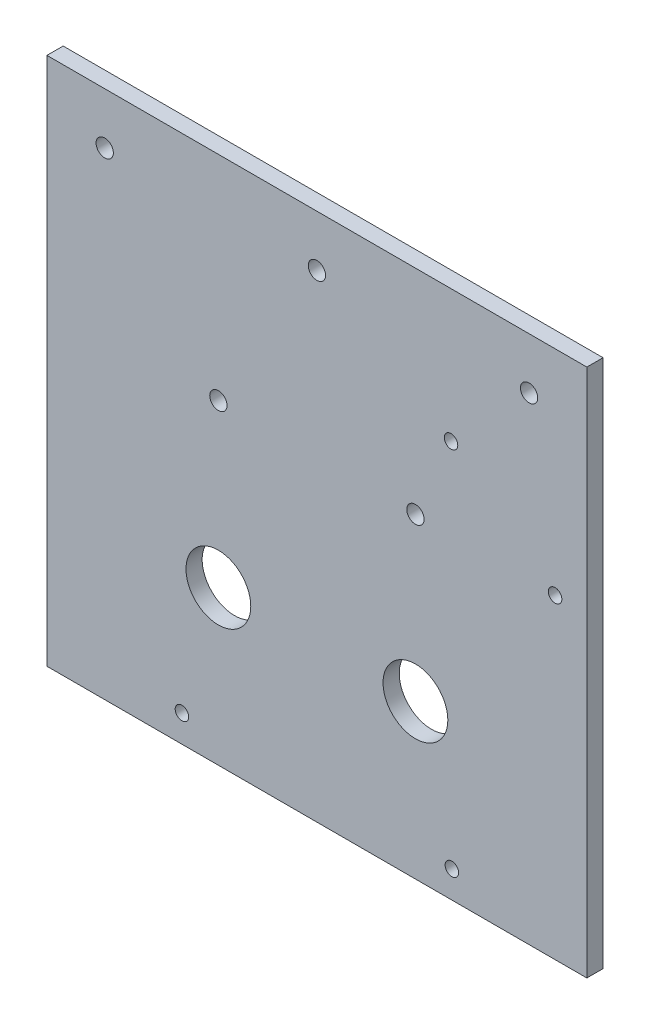
ISO-10303-21;
HEADER;
FILE_DESCRIPTION(('STEP AP214'),'2;1');
FILE_NAME('part.step','',(''),(''),'','','');
FILE_SCHEMA(('AUTOMOTIVE_DESIGN { 1 0 10303 214 1 1 1 1 }'));
ENDSEC;
DATA;
#1=APPLICATION_CONTEXT('core data for automotive mechanical design processes');
#2=APPLICATION_PROTOCOL_DEFINITION('international standard','automotive_design',2000,#1);
#3=PRODUCT_CONTEXT('',#1,'mechanical');
#4=PRODUCT('Part','Part','',(#3));
#5=PRODUCT_RELATED_PRODUCT_CATEGORY('part','',(#4));
#6=PRODUCT_DEFINITION_FORMATION('','',#4);
#7=PRODUCT_DEFINITION_CONTEXT('part definition',#1,'design');
#8=PRODUCT_DEFINITION('design','',#6,#7);
#9=PRODUCT_DEFINITION_SHAPE('','',#8);
#10=(LENGTH_UNIT() NAMED_UNIT(*) SI_UNIT(.MILLI.,.METRE.));
#11=(NAMED_UNIT(*) PLANE_ANGLE_UNIT() SI_UNIT($,.RADIAN.));
#12=(NAMED_UNIT(*) SI_UNIT($,.STERADIAN.) SOLID_ANGLE_UNIT());
#13=UNCERTAINTY_MEASURE_WITH_UNIT(LENGTH_MEASURE(1.E-05),#10,'distance_accuracy_value','');
#14=(GEOMETRIC_REPRESENTATION_CONTEXT(3) GLOBAL_UNCERTAINTY_ASSIGNED_CONTEXT((#13)) GLOBAL_UNIT_ASSIGNED_CONTEXT((#10,
#11,#12)) REPRESENTATION_CONTEXT('',''));
#15=CARTESIAN_POINT('',(0.,0.,0.));
#16=DIRECTION('',(0.,0.,1.));
#17=DIRECTION('',(1.,0.,0.));
#18=AXIS2_PLACEMENT_3D('',#15,#16,#17);
#19=CARTESIAN_POINT('',(50.,49.5,3.));
#20=DIRECTION('',(-1.,0.,0.));
#21=DIRECTION('',(0.,-1.,0.));
#22=AXIS2_PLACEMENT_3D('',#19,#20,#21);
#23=PLANE('',#22);
#24=DIRECTION('',(0.,0.,1.));
#25=VECTOR('',#24,1.);
#26=CARTESIAN_POINT('',(50.,-48.5,3.));
#27=LINE('',#26,#25);
#28=CARTESIAN_POINT('',(50.,-48.5,0.));
#29=VERTEX_POINT('',#28);
#30=CARTESIAN_POINT('',(50.,-48.5,3.));
#31=VERTEX_POINT('',#30);
#32=EDGE_CURVE('E117',#29,#31,#27,.T.);
#33=ORIENTED_EDGE('',*,*,#32,.F.);
#34=DIRECTION('',(0.,1.,0.));
#35=VECTOR('',#34,1.);
#36=CARTESIAN_POINT('',(50.,49.5,0.));
#37=LINE('',#36,#35);
#38=CARTESIAN_POINT('',(50.,49.5,0.));
#39=VERTEX_POINT('',#38);
#40=EDGE_CURVE('E80',#29,#39,#37,.T.);
#41=ORIENTED_EDGE('',*,*,#40,.T.);
#42=DIRECTION('',(0.,0.,-1.));
#43=VECTOR('',#42,1.);
#44=CARTESIAN_POINT('',(50.,49.5,3.));
#45=LINE('',#44,#43);
#46=CARTESIAN_POINT('',(50.,49.5,3.));
#47=VERTEX_POINT('',#46);
#48=EDGE_CURVE('E42',#47,#39,#45,.T.);
#49=ORIENTED_EDGE('',*,*,#48,.F.);
#50=DIRECTION('',(0.,1.,0.));
#51=VECTOR('',#50,1.);
#52=CARTESIAN_POINT('',(50.,49.5,3.));
#53=LINE('',#52,#51);
#54=EDGE_CURVE('E88',#31,#47,#53,.T.);
#55=ORIENTED_EDGE('',*,*,#54,.F.);
#56=EDGE_LOOP('',(#33,#41,#49,#55));
#57=FACE_BOUND('',#56,.T.);
#58=ADVANCED_FACE('F34',(#57),#23,.F.);
#59=CARTESIAN_POINT('',(-50.,49.5,3.));
#60=DIRECTION('',(1.,0.,0.));
#61=DIRECTION('',(0.,1.,0.));
#62=AXIS2_PLACEMENT_3D('',#59,#60,#61);
#63=PLANE('',#62);
#64=DIRECTION('',(0.,0.,-1.));
#65=VECTOR('',#64,1.);
#66=CARTESIAN_POINT('',(-50.,-48.5,3.));
#67=LINE('',#66,#65);
#68=CARTESIAN_POINT('',(-50.,-48.5,3.));
#69=VERTEX_POINT('',#68);
#70=CARTESIAN_POINT('',(-50.,-48.5,0.));
#71=VERTEX_POINT('',#70);
#72=EDGE_CURVE('E48',#69,#71,#67,.T.);
#73=ORIENTED_EDGE('',*,*,#72,.F.);
#74=DIRECTION('',(0.,-1.,0.));
#75=VECTOR('',#74,1.);
#76=CARTESIAN_POINT('',(-50.,49.5,3.));
#77=LINE('',#76,#75);
#78=CARTESIAN_POINT('',(-50.,49.5,3.));
#79=VERTEX_POINT('',#78);
#80=EDGE_CURVE('E85',#79,#69,#77,.T.);
#81=ORIENTED_EDGE('',*,*,#80,.F.);
#82=DIRECTION('',(0.,0.,-1.));
#83=VECTOR('',#82,1.);
#84=CARTESIAN_POINT('',(-50.,49.5,3.));
#85=LINE('',#84,#83);
#86=CARTESIAN_POINT('',(-50.,49.5,0.));
#87=VERTEX_POINT('',#86);
#88=EDGE_CURVE('E73',#79,#87,#85,.T.);
#89=ORIENTED_EDGE('',*,*,#88,.T.);
#90=DIRECTION('',(0.,-1.,0.));
#91=VECTOR('',#90,1.);
#92=CARTESIAN_POINT('',(-50.,49.5,0.));
#93=LINE('',#92,#91);
#94=EDGE_CURVE('E79',#87,#71,#93,.T.);
#95=ORIENTED_EDGE('',*,*,#94,.T.);
#96=EDGE_LOOP('',(#73,#81,#89,#95));
#97=FACE_BOUND('',#96,.T.);
#98=ADVANCED_FACE('F84',(#97),#63,.F.);
#99=CARTESIAN_POINT('',(0.,0.,3.));
#100=DIRECTION('',(0.,0.,1.));
#101=DIRECTION('',(1.,0.,0.));
#102=AXIS2_PLACEMENT_3D('',#99,#100,#101);
#103=PLANE('',#102);
#104=CARTESIAN_POINT('',(39.3,40.,3.));
#105=DIRECTION('',(0.,0.,1.));
#106=DIRECTION('',(1.,0.,0.));
#107=AXIS2_PLACEMENT_3D('',#104,#105,#106);
#108=CIRCLE('',#107,1.6);
#109=CARTESIAN_POINT('',(40.9,40.,3.));
#110=VERTEX_POINT('',#109);
#111=EDGE_CURVE('E152',#110,#110,#108,.T.);
#112=ORIENTED_EDGE('',*,*,#111,.F.);
#113=EDGE_LOOP('',(#112));
#114=FACE_BOUND('',#113,.T.);
#115=CARTESIAN_POINT('',(-39.3,40.,3.));
#116=DIRECTION('',(0.,0.,1.));
#117=DIRECTION('',(1.,0.,0.));
#118=AXIS2_PLACEMENT_3D('',#115,#116,#117);
#119=CIRCLE('',#118,1.6);
#120=CARTESIAN_POINT('',(-37.7,40.,3.));
#121=VERTEX_POINT('',#120);
#122=EDGE_CURVE('E157',#121,#121,#119,.T.);
#123=ORIENTED_EDGE('',*,*,#122,.F.);
#124=EDGE_LOOP('',(#123));
#125=FACE_BOUND('',#124,.T.);
#126=CARTESIAN_POINT('',(-18.25,10.,3.));
#127=DIRECTION('',(0.,0.,1.));
#128=DIRECTION('',(1.,0.,0.));
#129=AXIS2_PLACEMENT_3D('',#126,#127,#128);
#130=CIRCLE('',#129,1.6);
#131=CARTESIAN_POINT('',(-16.65,10.,3.));
#132=VERTEX_POINT('',#131);
#133=EDGE_CURVE('E142',#132,#132,#130,.T.);
#134=ORIENTED_EDGE('',*,*,#133,.F.);
#135=EDGE_LOOP('',(#134));
#136=FACE_BOUND('',#135,.T.);
#137=CARTESIAN_POINT('',(18.25,10.,3.));
#138=DIRECTION('',(0.,0.,1.));
#139=DIRECTION('',(1.,0.,0.));
#140=AXIS2_PLACEMENT_3D('',#137,#138,#139);
#141=CIRCLE('',#140,1.6);
#142=CARTESIAN_POINT('',(19.85,10.,3.));
#143=VERTEX_POINT('',#142);
#144=EDGE_CURVE('E145',#143,#143,#141,.T.);
#145=ORIENTED_EDGE('',*,*,#144,.F.);
#146=EDGE_LOOP('',(#145));
#147=FACE_BOUND('',#146,.T.);
#148=CARTESIAN_POINT('',(44.1226231407565,9.93476369878118,3.));
#149=DIRECTION('',(0.,0.,1.));
#150=DIRECTION('',(1.,0.,0.));
#151=AXIS2_PLACEMENT_3D('',#148,#149,#150);
#152=CIRCLE('',#151,1.24999999999999);
#153=CARTESIAN_POINT('',(45.3726231407565,9.93476369878118,3.));
#154=VERTEX_POINT('',#153);
#155=EDGE_CURVE('E136',#154,#154,#152,.T.);
#156=ORIENTED_EDGE('',*,*,#155,.F.);
#157=EDGE_LOOP('',(#156));
#158=FACE_BOUND('',#157,.T.);
#159=CARTESIAN_POINT('',(24.84,25.,3.));
#160=DIRECTION('',(0.,0.,1.));
#161=DIRECTION('',(1.,0.,0.));
#162=AXIS2_PLACEMENT_3D('',#159,#160,#161);
#163=CIRCLE('',#162,1.24999999999999);
#164=CARTESIAN_POINT('',(26.09,25.,3.));
#165=VERTEX_POINT('',#164);
#166=EDGE_CURVE('E37',#165,#165,#163,.T.);
#167=ORIENTED_EDGE('',*,*,#166,.F.);
#168=EDGE_LOOP('',(#167));
#169=FACE_BOUND('',#168,.T.);
#170=CARTESIAN_POINT('',(25.,-43.5,3.));
#171=DIRECTION('',(0.,0.,1.));
#172=DIRECTION('',(1.,0.,0.));
#173=AXIS2_PLACEMENT_3D('',#170,#171,#172);
#174=CIRCLE('',#173,1.24999999999999);
#175=CARTESIAN_POINT('',(26.25,-43.5,3.));
#176=VERTEX_POINT('',#175);
#177=EDGE_CURVE('E130',#176,#176,#174,.T.);
#178=ORIENTED_EDGE('',*,*,#177,.F.);
#179=EDGE_LOOP('',(#178));
#180=FACE_BOUND('',#179,.T.);
#181=CARTESIAN_POINT('',(-25.,-43.5,3.));
#182=DIRECTION('',(0.,0.,1.));
#183=DIRECTION('',(1.,0.,0.));
#184=AXIS2_PLACEMENT_3D('',#181,#182,#183);
#185=CIRCLE('',#184,1.24999999999999);
#186=CARTESIAN_POINT('',(-23.75,-43.5,3.));
#187=VERTEX_POINT('',#186);
#188=EDGE_CURVE('E124',#187,#187,#185,.T.);
#189=ORIENTED_EDGE('',*,*,#188,.F.);
#190=EDGE_LOOP('',(#189));
#191=FACE_BOUND('',#190,.T.);
#192=CARTESIAN_POINT('',(0.,40.,3.));
#193=DIRECTION('',(0.,0.,1.));
#194=DIRECTION('',(1.,0.,0.));
#195=AXIS2_PLACEMENT_3D('',#192,#193,#194);
#196=CIRCLE('',#195,1.6);
#197=CARTESIAN_POINT('',(1.6,40.,3.));
#198=VERTEX_POINT('',#197);
#199=EDGE_CURVE('E110',#198,#198,#196,.T.);
#200=ORIENTED_EDGE('',*,*,#199,.F.);
#201=EDGE_LOOP('',(#200));
#202=FACE_BOUND('',#201,.T.);
#203=CARTESIAN_POINT('',(-18.25,-20.,3.));
#204=DIRECTION('',(0.,0.,1.));
#205=DIRECTION('',(1.,0.,0.));
#206=AXIS2_PLACEMENT_3D('',#203,#204,#205);
#207=CIRCLE('',#206,6.);
#208=CARTESIAN_POINT('',(-12.25,-20.,3.));
#209=VERTEX_POINT('',#208);
#210=EDGE_CURVE('E104',#209,#209,#207,.T.);
#211=ORIENTED_EDGE('',*,*,#210,.F.);
#212=EDGE_LOOP('',(#211));
#213=FACE_BOUND('',#212,.T.);
#214=CARTESIAN_POINT('',(18.25,-20.,3.));
#215=DIRECTION('',(0.,0.,1.));
#216=DIRECTION('',(1.,0.,0.));
#217=AXIS2_PLACEMENT_3D('',#214,#215,#216);
#218=CIRCLE('',#217,6.);
#219=CARTESIAN_POINT('',(24.25,-20.,3.));
#220=VERTEX_POINT('',#219);
#221=EDGE_CURVE('E97',#220,#220,#218,.T.);
#222=ORIENTED_EDGE('',*,*,#221,.F.);
#223=EDGE_LOOP('',(#222));
#224=FACE_BOUND('',#223,.T.);
#225=ORIENTED_EDGE('',*,*,#80,.T.);
#226=DIRECTION('',(1.,0.,0.));
#227=VECTOR('',#226,1.);
#228=CARTESIAN_POINT('',(0.,-48.5,3.));
#229=LINE('',#228,#227);
#230=EDGE_CURVE('E101',#69,#31,#229,.T.);
#231=ORIENTED_EDGE('',*,*,#230,.T.);
#232=ORIENTED_EDGE('',*,*,#54,.T.);
#233=DIRECTION('',(-1.,0.,0.));
#234=VECTOR('',#233,1.);
#235=CARTESIAN_POINT('',(-50.,49.5,3.));
#236=LINE('',#235,#234);
#237=EDGE_CURVE('E57',#47,#79,#236,.T.);
#238=ORIENTED_EDGE('',*,*,#237,.T.);
#239=EDGE_LOOP('',(#225,#231,#232,#238));
#240=FACE_BOUND('',#239,.T.);
#241=ADVANCED_FACE('F171',(#114,#125,#136,#147,#158,#169,#180,#191,#202,#213,#224,#240),#103,.T.);
#242=CARTESIAN_POINT('',(0.,0.,0.));
#243=DIRECTION('',(0.,0.,1.));
#244=DIRECTION('',(1.,0.,0.));
#245=AXIS2_PLACEMENT_3D('',#242,#243,#244);
#246=PLANE('',#245);
#247=CARTESIAN_POINT('',(39.3,40.,0.));
#248=DIRECTION('',(0.,0.,-1.));
#249=DIRECTION('',(-1.,0.,0.));
#250=AXIS2_PLACEMENT_3D('',#247,#248,#249);
#251=CIRCLE('',#250,1.6);
#252=CARTESIAN_POINT('',(37.7,40.,0.));
#253=VERTEX_POINT('',#252);
#254=EDGE_CURVE('E160',#253,#253,#251,.T.);
#255=ORIENTED_EDGE('',*,*,#254,.F.);
#256=EDGE_LOOP('',(#255));
#257=FACE_BOUND('',#256,.T.);
#258=CARTESIAN_POINT('',(-39.3,40.,0.));
#259=DIRECTION('',(0.,0.,-1.));
#260=DIRECTION('',(-1.,0.,0.));
#261=AXIS2_PLACEMENT_3D('',#258,#259,#260);
#262=CIRCLE('',#261,1.6);
#263=CARTESIAN_POINT('',(-40.9,40.,0.));
#264=VERTEX_POINT('',#263);
#265=EDGE_CURVE('E161',#264,#264,#262,.T.);
#266=ORIENTED_EDGE('',*,*,#265,.F.);
#267=EDGE_LOOP('',(#266));
#268=FACE_BOUND('',#267,.T.);
#269=CARTESIAN_POINT('',(-18.25,10.,0.));
#270=DIRECTION('',(0.,0.,-1.));
#271=DIRECTION('',(-1.,0.,0.));
#272=AXIS2_PLACEMENT_3D('',#269,#270,#271);
#273=CIRCLE('',#272,1.6);
#274=CARTESIAN_POINT('',(-19.85,10.,0.));
#275=VERTEX_POINT('',#274);
#276=EDGE_CURVE('E148',#275,#275,#273,.T.);
#277=ORIENTED_EDGE('',*,*,#276,.F.);
#278=EDGE_LOOP('',(#277));
#279=FACE_BOUND('',#278,.T.);
#280=CARTESIAN_POINT('',(18.25,10.,0.));
#281=DIRECTION('',(0.,0.,-1.));
#282=DIRECTION('',(-1.,0.,0.));
#283=AXIS2_PLACEMENT_3D('',#280,#281,#282);
#284=CIRCLE('',#283,1.6);
#285=CARTESIAN_POINT('',(16.65,10.,0.));
#286=VERTEX_POINT('',#285);
#287=EDGE_CURVE('E149',#286,#286,#284,.T.);
#288=ORIENTED_EDGE('',*,*,#287,.F.);
#289=EDGE_LOOP('',(#288));
#290=FACE_BOUND('',#289,.T.);
#291=CARTESIAN_POINT('',(44.1226231407565,9.93476369878118,0.));
#292=DIRECTION('',(0.,0.,-1.));
#293=DIRECTION('',(-1.,0.,0.));
#294=AXIS2_PLACEMENT_3D('',#291,#292,#293);
#295=CIRCLE('',#294,1.24999999999999);
#296=CARTESIAN_POINT('',(42.8726231407565,9.93476369878118,0.));
#297=VERTEX_POINT('',#296);
#298=EDGE_CURVE('E139',#297,#297,#295,.T.);
#299=ORIENTED_EDGE('',*,*,#298,.F.);
#300=EDGE_LOOP('',(#299));
#301=FACE_BOUND('',#300,.T.);
#302=CARTESIAN_POINT('',(24.84,25.,0.));
#303=DIRECTION('',(0.,0.,-1.));
#304=DIRECTION('',(-1.,0.,0.));
#305=AXIS2_PLACEMENT_3D('',#302,#303,#304);
#306=CIRCLE('',#305,1.24999999999999);
#307=CARTESIAN_POINT('',(23.59,25.,0.));
#308=VERTEX_POINT('',#307);
#309=EDGE_CURVE('E133',#308,#308,#306,.T.);
#310=ORIENTED_EDGE('',*,*,#309,.F.);
#311=EDGE_LOOP('',(#310));
#312=FACE_BOUND('',#311,.T.);
#313=CARTESIAN_POINT('',(25.,-43.5,0.));
#314=DIRECTION('',(0.,0.,1.));
#315=DIRECTION('',(1.,0.,0.));
#316=AXIS2_PLACEMENT_3D('',#313,#314,#315);
#317=CIRCLE('',#316,1.24999999999999);
#318=CARTESIAN_POINT('',(26.25,-43.5,0.));
#319=VERTEX_POINT('',#318);
#320=EDGE_CURVE('E127',#319,#319,#317,.T.);
#321=ORIENTED_EDGE('',*,*,#320,.T.);
#322=EDGE_LOOP('',(#321));
#323=FACE_BOUND('',#322,.T.);
#324=CARTESIAN_POINT('',(-25.,-43.5,0.));
#325=DIRECTION('',(0.,0.,1.));
#326=DIRECTION('',(1.,0.,0.));
#327=AXIS2_PLACEMENT_3D('',#324,#325,#326);
#328=CIRCLE('',#327,1.24999999999999);
#329=CARTESIAN_POINT('',(-23.75,-43.5,0.));
#330=VERTEX_POINT('',#329);
#331=EDGE_CURVE('E121',#330,#330,#328,.T.);
#332=ORIENTED_EDGE('',*,*,#331,.T.);
#333=EDGE_LOOP('',(#332));
#334=FACE_BOUND('',#333,.T.);
#335=CARTESIAN_POINT('',(18.25,-20.,0.));
#336=DIRECTION('',(0.,0.,1.));
#337=DIRECTION('',(1.,0.,0.));
#338=AXIS2_PLACEMENT_3D('',#335,#336,#337);
#339=CIRCLE('',#338,6.);
#340=CARTESIAN_POINT('',(24.25,-20.,0.));
#341=VERTEX_POINT('',#340);
#342=EDGE_CURVE('E100',#341,#341,#339,.T.);
#343=ORIENTED_EDGE('',*,*,#342,.T.);
#344=EDGE_LOOP('',(#343));
#345=FACE_BOUND('',#344,.T.);
#346=CARTESIAN_POINT('',(-18.25,-20.,0.));
#347=DIRECTION('',(0.,0.,1.));
#348=DIRECTION('',(1.,0.,0.));
#349=AXIS2_PLACEMENT_3D('',#346,#347,#348);
#350=CIRCLE('',#349,6.);
#351=CARTESIAN_POINT('',(-12.25,-20.,0.));
#352=VERTEX_POINT('',#351);
#353=EDGE_CURVE('E107',#352,#352,#350,.T.);
#354=ORIENTED_EDGE('',*,*,#353,.T.);
#355=EDGE_LOOP('',(#354));
#356=FACE_BOUND('',#355,.T.);
#357=CARTESIAN_POINT('',(0.,40.,0.));
#358=DIRECTION('',(0.,0.,1.));
#359=DIRECTION('',(1.,0.,0.));
#360=AXIS2_PLACEMENT_3D('',#357,#358,#359);
#361=CIRCLE('',#360,1.6);
#362=CARTESIAN_POINT('',(1.6,40.,0.));
#363=VERTEX_POINT('',#362);
#364=EDGE_CURVE('E94',#363,#363,#361,.T.);
#365=ORIENTED_EDGE('',*,*,#364,.T.);
#366=EDGE_LOOP('',(#365));
#367=FACE_BOUND('',#366,.T.);
#368=DIRECTION('',(1.,0.,0.));
#369=VECTOR('',#368,1.);
#370=CARTESIAN_POINT('',(0.,-48.5,0.));
#371=LINE('',#370,#369);
#372=EDGE_CURVE('E11',#71,#29,#371,.T.);
#373=ORIENTED_EDGE('',*,*,#372,.F.);
#374=ORIENTED_EDGE('',*,*,#94,.F.);
#375=DIRECTION('',(-1.,0.,0.));
#376=VECTOR('',#375,1.);
#377=CARTESIAN_POINT('',(-50.,49.5,0.));
#378=LINE('',#377,#376);
#379=EDGE_CURVE('E70',#39,#87,#378,.T.);
#380=ORIENTED_EDGE('',*,*,#379,.F.);
#381=ORIENTED_EDGE('',*,*,#40,.F.);
#382=EDGE_LOOP('',(#373,#374,#380,#381));
#383=FACE_BOUND('',#382,.T.);
#384=ADVANCED_FACE('F87',(#257,#268,#279,#290,#301,#312,#323,#334,#345,#356,#367,#383),#246,.F.);
#385=CARTESIAN_POINT('',(-50.,49.5,3.));
#386=DIRECTION('',(0.,-1.,0.));
#387=DIRECTION('',(0.,0.,-1.));
#388=AXIS2_PLACEMENT_3D('',#385,#386,#387);
#389=PLANE('',#388);
#390=ORIENTED_EDGE('',*,*,#379,.T.);
#391=ORIENTED_EDGE('',*,*,#88,.F.);
#392=ORIENTED_EDGE('',*,*,#237,.F.);
#393=ORIENTED_EDGE('',*,*,#48,.T.);
#394=EDGE_LOOP('',(#390,#391,#392,#393));
#395=FACE_BOUND('',#394,.T.);
#396=ADVANCED_FACE('F72',(#395),#389,.F.);
#397=CARTESIAN_POINT('',(18.25,-20.,0.));
#398=DIRECTION('',(0.,0.,1.));
#399=DIRECTION('',(1.,0.,0.));
#400=AXIS2_PLACEMENT_3D('',#397,#398,#399);
#401=CYLINDRICAL_SURFACE('',#400,6.);
#402=ORIENTED_EDGE('',*,*,#342,.F.);
#403=EDGE_LOOP('',(#402));
#404=FACE_BOUND('',#403,.T.);
#405=ORIENTED_EDGE('',*,*,#221,.T.);
#406=EDGE_LOOP('',(#405));
#407=FACE_BOUND('',#406,.T.);
#408=ADVANCED_FACE('F224',(#404,#407),#401,.F.);
#409=CARTESIAN_POINT('',(-18.25,-20.,0.));
#410=DIRECTION('',(0.,0.,1.));
#411=DIRECTION('',(1.,0.,0.));
#412=AXIS2_PLACEMENT_3D('',#409,#410,#411);
#413=CYLINDRICAL_SURFACE('',#412,6.);
#414=ORIENTED_EDGE('',*,*,#353,.F.);
#415=EDGE_LOOP('',(#414));
#416=FACE_BOUND('',#415,.T.);
#417=ORIENTED_EDGE('',*,*,#210,.T.);
#418=EDGE_LOOP('',(#417));
#419=FACE_BOUND('',#418,.T.);
#420=ADVANCED_FACE('F197',(#416,#419),#413,.F.);
#421=CARTESIAN_POINT('',(0.,40.,0.));
#422=DIRECTION('',(0.,0.,1.));
#423=DIRECTION('',(1.,0.,0.));
#424=AXIS2_PLACEMENT_3D('',#421,#422,#423);
#425=CYLINDRICAL_SURFACE('',#424,1.6);
#426=ORIENTED_EDGE('',*,*,#364,.F.);
#427=EDGE_LOOP('',(#426));
#428=FACE_BOUND('',#427,.T.);
#429=ORIENTED_EDGE('',*,*,#199,.T.);
#430=EDGE_LOOP('',(#429));
#431=FACE_BOUND('',#430,.T.);
#432=ADVANCED_FACE('F193',(#428,#431),#425,.F.);
#433=CARTESIAN_POINT('',(0.,-48.5,0.));
#434=DIRECTION('',(0.,-1.,0.));
#435=DIRECTION('',(0.,0.,-1.));
#436=AXIS2_PLACEMENT_3D('',#433,#434,#435);
#437=PLANE('',#436);
#438=ORIENTED_EDGE('',*,*,#72,.T.);
#439=ORIENTED_EDGE('',*,*,#372,.T.);
#440=ORIENTED_EDGE('',*,*,#32,.T.);
#441=ORIENTED_EDGE('',*,*,#230,.F.);
#442=EDGE_LOOP('',(#438,#439,#440,#441));
#443=FACE_BOUND('',#442,.T.);
#444=ADVANCED_FACE('F196',(#443),#437,.T.);
#445=CARTESIAN_POINT('',(-25.,-43.5,3.));
#446=DIRECTION('',(0.,0.,1.));
#447=DIRECTION('',(1.,0.,0.));
#448=AXIS2_PLACEMENT_3D('',#445,#446,#447);
#449=CYLINDRICAL_SURFACE('',#448,1.24999999999999);
#450=ORIENTED_EDGE('',*,*,#188,.T.);
#451=EDGE_LOOP('',(#450));
#452=FACE_BOUND('',#451,.T.);
#453=ORIENTED_EDGE('',*,*,#331,.F.);
#454=EDGE_LOOP('',(#453));
#455=FACE_BOUND('',#454,.T.);
#456=ADVANCED_FACE('F240',(#452,#455),#449,.F.);
#457=CARTESIAN_POINT('',(25.,-43.5,3.));
#458=DIRECTION('',(0.,0.,1.));
#459=DIRECTION('',(1.,0.,0.));
#460=AXIS2_PLACEMENT_3D('',#457,#458,#459);
#461=CYLINDRICAL_SURFACE('',#460,1.24999999999999);
#462=ORIENTED_EDGE('',*,*,#177,.T.);
#463=EDGE_LOOP('',(#462));
#464=FACE_BOUND('',#463,.T.);
#465=ORIENTED_EDGE('',*,*,#320,.F.);
#466=EDGE_LOOP('',(#465));
#467=FACE_BOUND('',#466,.T.);
#468=ADVANCED_FACE('F243',(#464,#467),#461,.F.);
#469=CARTESIAN_POINT('',(24.84,25.,0.));
#470=DIRECTION('',(0.,0.,-1.));
#471=DIRECTION('',(-1.,0.,0.));
#472=AXIS2_PLACEMENT_3D('',#469,#470,#471);
#473=CYLINDRICAL_SURFACE('',#472,1.24999999999999);
#474=ORIENTED_EDGE('',*,*,#166,.T.);
#475=EDGE_LOOP('',(#474));
#476=FACE_BOUND('',#475,.T.);
#477=ORIENTED_EDGE('',*,*,#309,.T.);
#478=EDGE_LOOP('',(#477));
#479=FACE_BOUND('',#478,.T.);
#480=ADVANCED_FACE('F247',(#476,#479),#473,.F.);
#481=CARTESIAN_POINT('',(44.1226231407565,9.93476369878118,0.));
#482=DIRECTION('',(0.,0.,-1.));
#483=DIRECTION('',(-1.,0.,0.));
#484=AXIS2_PLACEMENT_3D('',#481,#482,#483);
#485=CYLINDRICAL_SURFACE('',#484,1.24999999999999);
#486=ORIENTED_EDGE('',*,*,#155,.T.);
#487=EDGE_LOOP('',(#486));
#488=FACE_BOUND('',#487,.T.);
#489=ORIENTED_EDGE('',*,*,#298,.T.);
#490=EDGE_LOOP('',(#489));
#491=FACE_BOUND('',#490,.T.);
#492=ADVANCED_FACE('F251',(#488,#491),#485,.F.);
#493=CARTESIAN_POINT('',(18.25,10.,10.));
#494=DIRECTION('',(0.,0.,-1.));
#495=DIRECTION('',(-1.,0.,0.));
#496=AXIS2_PLACEMENT_3D('',#493,#494,#495);
#497=CYLINDRICAL_SURFACE('',#496,1.6);
#498=ORIENTED_EDGE('',*,*,#144,.T.);
#499=EDGE_LOOP('',(#498));
#500=FACE_BOUND('',#499,.T.);
#501=ORIENTED_EDGE('',*,*,#287,.T.);
#502=EDGE_LOOP('',(#501));
#503=FACE_BOUND('',#502,.T.);
#504=ADVANCED_FACE('F255',(#500,#503),#497,.F.);
#505=CARTESIAN_POINT('',(-18.25,10.,10.));
#506=DIRECTION('',(0.,0.,-1.));
#507=DIRECTION('',(-1.,0.,0.));
#508=AXIS2_PLACEMENT_3D('',#505,#506,#507);
#509=CYLINDRICAL_SURFACE('',#508,1.6);
#510=ORIENTED_EDGE('',*,*,#133,.T.);
#511=EDGE_LOOP('',(#510));
#512=FACE_BOUND('',#511,.T.);
#513=ORIENTED_EDGE('',*,*,#276,.T.);
#514=EDGE_LOOP('',(#513));
#515=FACE_BOUND('',#514,.T.);
#516=ADVANCED_FACE('F259',(#512,#515),#509,.F.);
#517=CARTESIAN_POINT('',(-39.3,40.,10.));
#518=DIRECTION('',(0.,0.,-1.));
#519=DIRECTION('',(-1.,0.,0.));
#520=AXIS2_PLACEMENT_3D('',#517,#518,#519);
#521=CYLINDRICAL_SURFACE('',#520,1.6);
#522=ORIENTED_EDGE('',*,*,#122,.T.);
#523=EDGE_LOOP('',(#522));
#524=FACE_BOUND('',#523,.T.);
#525=ORIENTED_EDGE('',*,*,#265,.T.);
#526=EDGE_LOOP('',(#525));
#527=FACE_BOUND('',#526,.T.);
#528=ADVANCED_FACE('F263',(#524,#527),#521,.F.);
#529=CARTESIAN_POINT('',(39.3,40.,10.));
#530=DIRECTION('',(0.,0.,-1.));
#531=DIRECTION('',(-1.,0.,0.));
#532=AXIS2_PLACEMENT_3D('',#529,#530,#531);
#533=CYLINDRICAL_SURFACE('',#532,1.6);
#534=ORIENTED_EDGE('',*,*,#111,.T.);
#535=EDGE_LOOP('',(#534));
#536=FACE_BOUND('',#535,.T.);
#537=ORIENTED_EDGE('',*,*,#254,.T.);
#538=EDGE_LOOP('',(#537));
#539=FACE_BOUND('',#538,.T.);
#540=ADVANCED_FACE('F167',(#536,#539),#533,.F.);
#541=CLOSED_SHELL('',(#58,#98,#241,#384,#396,#408,#420,#432,#444,#456,#468,#480,#492,#504,#516,
#528,#540));
#542=MANIFOLD_SOLID_BREP('B2',#541);
#543=ADVANCED_BREP_SHAPE_REPRESENTATION('',(#18,#542),#14);
#544=SHAPE_DEFINITION_REPRESENTATION(#9,#543);
ENDSEC;
END-ISO-10303-21;
